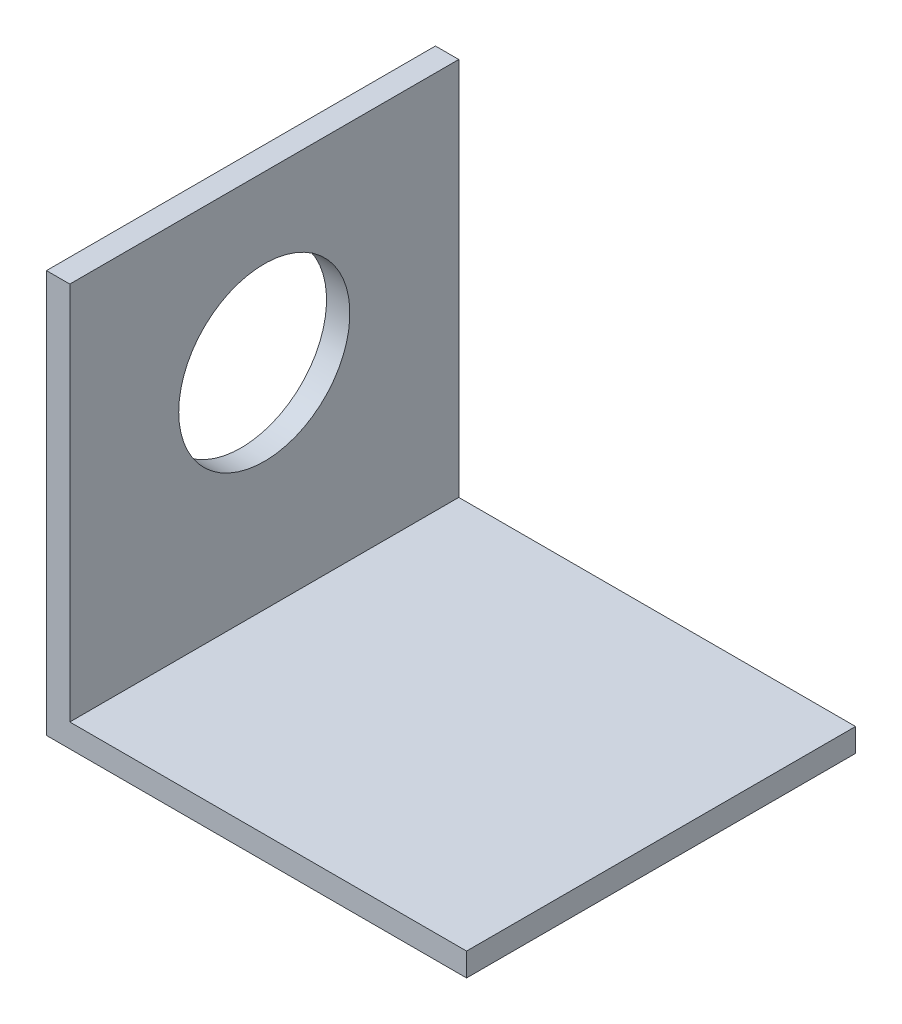
ISO-10303-21;
HEADER;
FILE_DESCRIPTION(('STEP AP214'),'2;1');
FILE_NAME('part.step','',(''),(''),'','','');
FILE_SCHEMA(('AUTOMOTIVE_DESIGN { 1 0 10303 214 1 1 1 1 }'));
ENDSEC;
DATA;
#1=APPLICATION_CONTEXT('core data for automotive mechanical design processes');
#2=APPLICATION_PROTOCOL_DEFINITION('international standard','automotive_design',2000,#1);
#3=PRODUCT_CONTEXT('',#1,'mechanical');
#4=PRODUCT('Part','Part','',(#3));
#5=PRODUCT_RELATED_PRODUCT_CATEGORY('part','',(#4));
#6=PRODUCT_DEFINITION_FORMATION('','',#4);
#7=PRODUCT_DEFINITION_CONTEXT('part definition',#1,'design');
#8=PRODUCT_DEFINITION('design','',#6,#7);
#9=PRODUCT_DEFINITION_SHAPE('','',#8);
#10=(LENGTH_UNIT() NAMED_UNIT(*) SI_UNIT(.MILLI.,.METRE.));
#11=(NAMED_UNIT(*) PLANE_ANGLE_UNIT() SI_UNIT($,.RADIAN.));
#12=(NAMED_UNIT(*) SI_UNIT($,.STERADIAN.) SOLID_ANGLE_UNIT());
#13=UNCERTAINTY_MEASURE_WITH_UNIT(LENGTH_MEASURE(1.E-05),#10,'distance_accuracy_value','');
#14=(GEOMETRIC_REPRESENTATION_CONTEXT(3) GLOBAL_UNCERTAINTY_ASSIGNED_CONTEXT((#13)) GLOBAL_UNIT_ASSIGNED_CONTEXT((#10,
#11,#12)) REPRESENTATION_CONTEXT('',''));
#15=CARTESIAN_POINT('',(0.,0.,0.));
#16=DIRECTION('',(0.,0.,1.));
#17=DIRECTION('',(1.,0.,0.));
#18=AXIS2_PLACEMENT_3D('',#15,#16,#17);
#19=CARTESIAN_POINT('',(27.,3.,-25.));
#20=DIRECTION('',(-1.,0.,0.));
#21=DIRECTION('',(0.,0.,1.));
#22=AXIS2_PLACEMENT_3D('',#19,#20,#21);
#23=PLANE('',#22);
#24=DIRECTION('',(0.,0.,-1.));
#25=VECTOR('',#24,1.);
#26=CARTESIAN_POINT('',(27.,0.,-25.));
#27=LINE('',#26,#25);
#28=CARTESIAN_POINT('',(27.,0.,25.));
#29=VERTEX_POINT('',#28);
#30=CARTESIAN_POINT('',(27.,0.,-25.));
#31=VERTEX_POINT('',#30);
#32=EDGE_CURVE('E92',#29,#31,#27,.T.);
#33=ORIENTED_EDGE('',*,*,#32,.T.);
#34=DIRECTION('',(0.,-1.,0.));
#35=VECTOR('',#34,1.);
#36=CARTESIAN_POINT('',(27.,3.,-25.));
#37=LINE('',#36,#35);
#38=CARTESIAN_POINT('',(27.,3.,-25.));
#39=VERTEX_POINT('',#38);
#40=EDGE_CURVE('E11',#39,#31,#37,.T.);
#41=ORIENTED_EDGE('',*,*,#40,.F.);
#42=DIRECTION('',(0.,0.,-1.));
#43=VECTOR('',#42,1.);
#44=CARTESIAN_POINT('',(27.,3.,-25.));
#45=LINE('',#44,#43);
#46=CARTESIAN_POINT('',(27.,3.,25.));
#47=VERTEX_POINT('',#46);
#48=EDGE_CURVE('E86',#47,#39,#45,.T.);
#49=ORIENTED_EDGE('',*,*,#48,.F.);
#50=DIRECTION('',(0.,-1.,0.));
#51=VECTOR('',#50,1.);
#52=CARTESIAN_POINT('',(27.,3.,25.));
#53=LINE('',#52,#51);
#54=EDGE_CURVE('E78',#47,#29,#53,.T.);
#55=ORIENTED_EDGE('',*,*,#54,.T.);
#56=EDGE_LOOP('',(#33,#41,#49,#55));
#57=FACE_BOUND('',#56,.T.);
#58=ADVANCED_FACE('F35',(#57),#23,.F.);
#59=CARTESIAN_POINT('',(-27.,3.,-25.));
#60=DIRECTION('',(0.,0.,1.));
#61=DIRECTION('',(1.,0.,0.));
#62=AXIS2_PLACEMENT_3D('',#59,#60,#61);
#63=PLANE('',#62);
#64=DIRECTION('',(-1.,0.,0.));
#65=VECTOR('',#64,1.);
#66=CARTESIAN_POINT('',(-27.,0.,-25.));
#67=LINE('',#66,#65);
#68=CARTESIAN_POINT('',(-27.,0.,-25.));
#69=VERTEX_POINT('',#68);
#70=EDGE_CURVE('E95',#31,#69,#67,.T.);
#71=ORIENTED_EDGE('',*,*,#70,.T.);
#72=DIRECTION('',(0.,-1.,0.));
#73=VECTOR('',#72,1.);
#74=CARTESIAN_POINT('',(-27.,3.,-25.));
#75=LINE('',#74,#73);
#76=CARTESIAN_POINT('',(-27.,51.75,-25.));
#77=VERTEX_POINT('',#76);
#78=EDGE_CURVE('E43',#77,#69,#75,.T.);
#79=ORIENTED_EDGE('',*,*,#78,.F.);
#80=DIRECTION('',(-1.,0.,0.));
#81=VECTOR('',#80,1.);
#82=CARTESIAN_POINT('',(-27.,51.75,-25.));
#83=LINE('',#82,#81);
#84=CARTESIAN_POINT('',(-24.,51.75,-25.));
#85=VERTEX_POINT('',#84);
#86=EDGE_CURVE('E120',#85,#77,#83,.T.);
#87=ORIENTED_EDGE('',*,*,#86,.F.);
#88=DIRECTION('',(0.,-1.,0.));
#89=VECTOR('',#88,1.);
#90=CARTESIAN_POINT('',(-24.,51.75,-25.));
#91=LINE('',#90,#89);
#92=CARTESIAN_POINT('',(-24.,3.,-25.));
#93=VERTEX_POINT('',#92);
#94=EDGE_CURVE('E100',#85,#93,#91,.T.);
#95=ORIENTED_EDGE('',*,*,#94,.T.);
#96=DIRECTION('',(-1.,0.,0.));
#97=VECTOR('',#96,1.);
#98=CARTESIAN_POINT('',(-27.,3.,-25.));
#99=LINE('',#98,#97);
#100=EDGE_CURVE('E137',#39,#93,#99,.T.);
#101=ORIENTED_EDGE('',*,*,#100,.F.);
#102=ORIENTED_EDGE('',*,*,#40,.T.);
#103=EDGE_LOOP('',(#71,#79,#87,#95,#101,#102));
#104=FACE_BOUND('',#103,.T.);
#105=ADVANCED_FACE('F117',(#104),#63,.F.);
#106=CARTESIAN_POINT('',(-27.,3.,-25.));
#107=DIRECTION('',(1.,0.,0.));
#108=DIRECTION('',(0.,0.,-1.));
#109=AXIS2_PLACEMENT_3D('',#106,#107,#108);
#110=PLANE('',#109);
#111=CARTESIAN_POINT('',(-27.,30.5,0.));
#112=DIRECTION('',(-1.,0.,0.));
#113=DIRECTION('',(0.,0.,1.));
#114=AXIS2_PLACEMENT_3D('',#111,#112,#113);
#115=CIRCLE('',#114,11.);
#116=CARTESIAN_POINT('',(-27.,30.5,11.));
#117=VERTEX_POINT('',#116);
#118=EDGE_CURVE('E149',#117,#117,#115,.T.);
#119=ORIENTED_EDGE('',*,*,#118,.F.);
#120=EDGE_LOOP('',(#119));
#121=FACE_BOUND('',#120,.T.);
#122=DIRECTION('',(0.,0.,1.));
#123=VECTOR('',#122,1.);
#124=CARTESIAN_POINT('',(-27.,0.,-25.));
#125=LINE('',#124,#123);
#126=CARTESIAN_POINT('',(-27.,0.,25.));
#127=VERTEX_POINT('',#126);
#128=EDGE_CURVE('E87',#69,#127,#125,.T.);
#129=ORIENTED_EDGE('',*,*,#128,.T.);
#130=DIRECTION('',(0.,-1.,0.));
#131=VECTOR('',#130,1.);
#132=CARTESIAN_POINT('',(-27.,3.,25.));
#133=LINE('',#132,#131);
#134=CARTESIAN_POINT('',(-27.,51.75,25.));
#135=VERTEX_POINT('',#134);
#136=EDGE_CURVE('E82',#135,#127,#133,.T.);
#137=ORIENTED_EDGE('',*,*,#136,.F.);
#138=DIRECTION('',(0.,0.,1.));
#139=VECTOR('',#138,1.);
#140=CARTESIAN_POINT('',(-27.,51.75,-25.));
#141=LINE('',#140,#139);
#142=EDGE_CURVE('E113',#77,#135,#141,.T.);
#143=ORIENTED_EDGE('',*,*,#142,.F.);
#144=ORIENTED_EDGE('',*,*,#78,.T.);
#145=EDGE_LOOP('',(#129,#137,#143,#144));
#146=FACE_BOUND('',#145,.T.);
#147=ADVANCED_FACE('F111',(#121,#146),#110,.F.);
#148=CARTESIAN_POINT('',(-27.,3.,25.));
#149=DIRECTION('',(0.,0.,-1.));
#150=DIRECTION('',(-1.,0.,0.));
#151=AXIS2_PLACEMENT_3D('',#148,#149,#150);
#152=PLANE('',#151);
#153=DIRECTION('',(1.,0.,0.));
#154=VECTOR('',#153,1.);
#155=CARTESIAN_POINT('',(-27.,0.,25.));
#156=LINE('',#155,#154);
#157=EDGE_CURVE('E75',#127,#29,#156,.T.);
#158=ORIENTED_EDGE('',*,*,#157,.T.);
#159=ORIENTED_EDGE('',*,*,#54,.F.);
#160=DIRECTION('',(1.,0.,0.));
#161=VECTOR('',#160,1.);
#162=CARTESIAN_POINT('',(-27.,3.,25.));
#163=LINE('',#162,#161);
#164=CARTESIAN_POINT('',(-24.,3.,25.));
#165=VERTEX_POINT('',#164);
#166=EDGE_CURVE('E55',#165,#47,#163,.T.);
#167=ORIENTED_EDGE('',*,*,#166,.F.);
#168=DIRECTION('',(0.,-1.,0.));
#169=VECTOR('',#168,1.);
#170=CARTESIAN_POINT('',(-24.,51.75,25.));
#171=LINE('',#170,#169);
#172=CARTESIAN_POINT('',(-24.,51.75,25.));
#173=VERTEX_POINT('',#172);
#174=EDGE_CURVE('E96',#173,#165,#171,.T.);
#175=ORIENTED_EDGE('',*,*,#174,.F.);
#176=DIRECTION('',(1.,0.,0.));
#177=VECTOR('',#176,1.);
#178=CARTESIAN_POINT('',(-27.,51.75,25.));
#179=LINE('',#178,#177);
#180=EDGE_CURVE('E132',#135,#173,#179,.T.);
#181=ORIENTED_EDGE('',*,*,#180,.F.);
#182=ORIENTED_EDGE('',*,*,#136,.T.);
#183=EDGE_LOOP('',(#158,#159,#167,#175,#181,#182));
#184=FACE_BOUND('',#183,.T.);
#185=ADVANCED_FACE('F77',(#184),#152,.F.);
#186=CARTESIAN_POINT('',(0.,3.,0.));
#187=DIRECTION('',(0.,1.,0.));
#188=DIRECTION('',(0.,0.,1.));
#189=AXIS2_PLACEMENT_3D('',#186,#187,#188);
#190=PLANE('',#189);
#191=DIRECTION('',(0.,0.,-1.));
#192=VECTOR('',#191,1.);
#193=CARTESIAN_POINT('',(-24.,3.,-25.));
#194=LINE('',#193,#192);
#195=EDGE_CURVE('E50',#165,#93,#194,.T.);
#196=ORIENTED_EDGE('',*,*,#195,.F.);
#197=ORIENTED_EDGE('',*,*,#166,.T.);
#198=ORIENTED_EDGE('',*,*,#48,.T.);
#199=ORIENTED_EDGE('',*,*,#100,.T.);
#200=EDGE_LOOP('',(#196,#197,#198,#199));
#201=FACE_BOUND('',#200,.T.);
#202=ADVANCED_FACE('F139',(#201),#190,.T.);
#203=CARTESIAN_POINT('',(0.,0.,0.));
#204=DIRECTION('',(0.,1.,0.));
#205=DIRECTION('',(0.,0.,1.));
#206=AXIS2_PLACEMENT_3D('',#203,#204,#205);
#207=PLANE('',#206);
#208=ORIENTED_EDGE('',*,*,#32,.F.);
#209=ORIENTED_EDGE('',*,*,#157,.F.);
#210=ORIENTED_EDGE('',*,*,#128,.F.);
#211=ORIENTED_EDGE('',*,*,#70,.F.);
#212=EDGE_LOOP('',(#208,#209,#210,#211));
#213=FACE_BOUND('',#212,.T.);
#214=ADVANCED_FACE('F94',(#213),#207,.F.);
#215=CARTESIAN_POINT('',(-24.,51.75,-25.));
#216=DIRECTION('',(-1.,0.,0.));
#217=DIRECTION('',(0.,0.,1.));
#218=AXIS2_PLACEMENT_3D('',#215,#216,#217);
#219=PLANE('',#218);
#220=CARTESIAN_POINT('',(-24.,30.5,0.));
#221=DIRECTION('',(-1.,0.,0.));
#222=DIRECTION('',(0.,0.,1.));
#223=AXIS2_PLACEMENT_3D('',#220,#221,#222);
#224=CIRCLE('',#223,11.);
#225=CARTESIAN_POINT('',(-24.,30.5,11.));
#226=VERTEX_POINT('',#225);
#227=EDGE_CURVE('E38',#226,#226,#224,.T.);
#228=ORIENTED_EDGE('',*,*,#227,.T.);
#229=EDGE_LOOP('',(#228));
#230=FACE_BOUND('',#229,.T.);
#231=ORIENTED_EDGE('',*,*,#195,.T.);
#232=ORIENTED_EDGE('',*,*,#94,.F.);
#233=DIRECTION('',(0.,0.,-1.));
#234=VECTOR('',#233,1.);
#235=CARTESIAN_POINT('',(-24.,51.75,-25.));
#236=LINE('',#235,#234);
#237=EDGE_CURVE('E128',#173,#85,#236,.T.);
#238=ORIENTED_EDGE('',*,*,#237,.F.);
#239=ORIENTED_EDGE('',*,*,#174,.T.);
#240=EDGE_LOOP('',(#231,#232,#238,#239));
#241=FACE_BOUND('',#240,.T.);
#242=ADVANCED_FACE('F141',(#230,#241),#219,.F.);
#243=CARTESIAN_POINT('',(0.,51.75,0.));
#244=DIRECTION('',(0.,1.,0.));
#245=DIRECTION('',(0.,0.,1.));
#246=AXIS2_PLACEMENT_3D('',#243,#244,#245);
#247=PLANE('',#246);
#248=ORIENTED_EDGE('',*,*,#142,.T.);
#249=ORIENTED_EDGE('',*,*,#180,.T.);
#250=ORIENTED_EDGE('',*,*,#237,.T.);
#251=ORIENTED_EDGE('',*,*,#86,.T.);
#252=EDGE_LOOP('',(#248,#249,#250,#251));
#253=FACE_BOUND('',#252,.T.);
#254=ADVANCED_FACE('F124',(#253),#247,.T.);
#255=CARTESIAN_POINT('',(27.,30.5,0.));
#256=DIRECTION('',(-1.,0.,0.));
#257=DIRECTION('',(0.,0.,1.));
#258=AXIS2_PLACEMENT_3D('',#255,#256,#257);
#259=CYLINDRICAL_SURFACE('',#258,11.);
#260=ORIENTED_EDGE('',*,*,#118,.T.);
#261=EDGE_LOOP('',(#260));
#262=FACE_BOUND('',#261,.T.);
#263=ORIENTED_EDGE('',*,*,#227,.F.);
#264=EDGE_LOOP('',(#263));
#265=FACE_BOUND('',#264,.T.);
#266=ADVANCED_FACE('F157',(#262,#265),#259,.F.);
#267=CLOSED_SHELL('',(#58,#105,#147,#185,#202,#214,#242,#254,#266));
#268=MANIFOLD_SOLID_BREP('B2',#267);
#269=ADVANCED_BREP_SHAPE_REPRESENTATION('',(#18,#268),#14);
#270=SHAPE_DEFINITION_REPRESENTATION(#9,#269);
ENDSEC;
END-ISO-10303-21;
